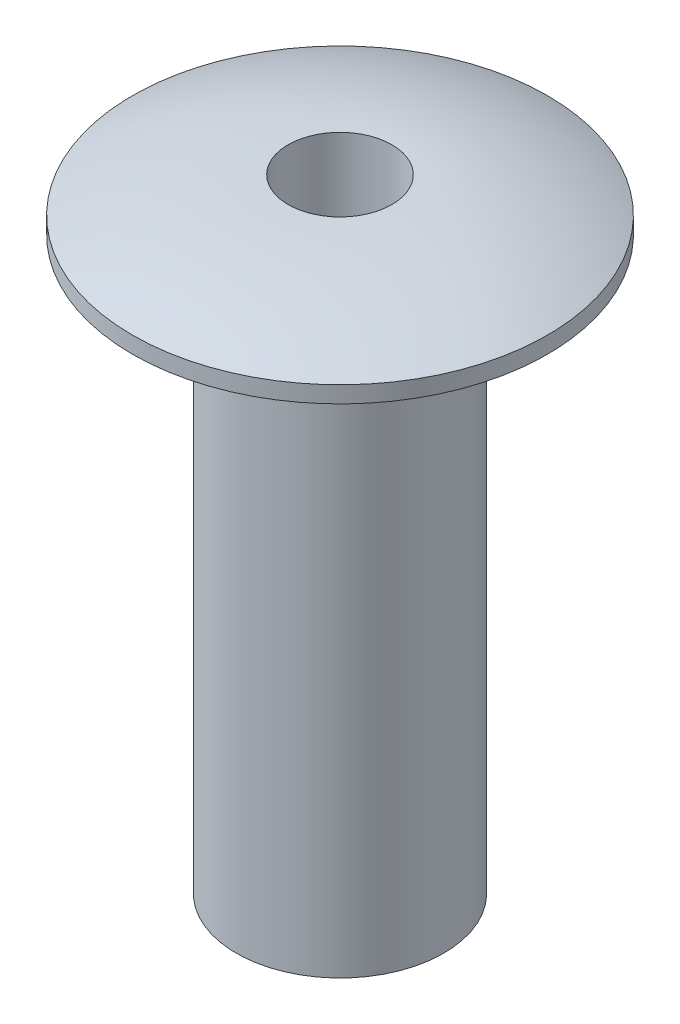
ISO-10303-21;
HEADER;
FILE_DESCRIPTION(('STEP AP214'),'2;1');
FILE_NAME('part.step','',(''),(''),'','','');
FILE_SCHEMA(('AUTOMOTIVE_DESIGN { 1 0 10303 214 1 1 1 1 }'));
ENDSEC;
DATA;
#1=APPLICATION_CONTEXT('core data for automotive mechanical design processes');
#2=APPLICATION_PROTOCOL_DEFINITION('international standard','automotive_design',2000,#1);
#3=PRODUCT_CONTEXT('',#1,'mechanical');
#4=PRODUCT('Part','Part','',(#3));
#5=PRODUCT_RELATED_PRODUCT_CATEGORY('part','',(#4));
#6=PRODUCT_DEFINITION_FORMATION('','',#4);
#7=PRODUCT_DEFINITION_CONTEXT('part definition',#1,'design');
#8=PRODUCT_DEFINITION('design','',#6,#7);
#9=PRODUCT_DEFINITION_SHAPE('','',#8);
#10=(LENGTH_UNIT() NAMED_UNIT(*) SI_UNIT(.MILLI.,.METRE.));
#11=(NAMED_UNIT(*) PLANE_ANGLE_UNIT() SI_UNIT($,.RADIAN.));
#12=(NAMED_UNIT(*) SI_UNIT($,.STERADIAN.) SOLID_ANGLE_UNIT());
#13=UNCERTAINTY_MEASURE_WITH_UNIT(LENGTH_MEASURE(1.E-05),#10,'distance_accuracy_value','');
#14=(GEOMETRIC_REPRESENTATION_CONTEXT(3) GLOBAL_UNCERTAINTY_ASSIGNED_CONTEXT((#13)) GLOBAL_UNIT_ASSIGNED_CONTEXT((#10,
#11,#12)) REPRESENTATION_CONTEXT('',''));
#15=CARTESIAN_POINT('',(0.,0.,0.));
#16=DIRECTION('',(0.,0.,1.));
#17=DIRECTION('',(1.,0.,0.));
#18=AXIS2_PLACEMENT_3D('',#15,#16,#17);
#19=CARTESIAN_POINT('',(0.,4.00236764705881,-0.79375));
#20=DIRECTION('',(1.,0.,0.));
#21=DIRECTION('',(0.,0.,-1.));
#22=AXIS2_PLACEMENT_3D('',#19,#20,#21);
#23=CIRCLE('',#22,5.52263235294119);
#24=TRIMMED_CURVE('',#23,(PARAMETER_VALUE(-1.71502257047458)),
(PARAMETER_VALUE(1.71502257047458)),.T.,.PARAMETER.);
#25=CARTESIAN_POINT('',(0.,4.00236764705881,0.));
#26=DIRECTION('',(0.,-1.,0.));
#27=AXIS1_PLACEMENT('',#25,#26);
#28=SURFACE_OF_REVOLUTION('',#24,#27);
#29=CARTESIAN_POINT('',(0.,9.525,0.));
#30=DIRECTION('',(0.,-1.,0.));
#31=DIRECTION('',(0.,0.,-1.));
#32=AXIS2_PLACEMENT_3D('',#29,#30,#31);
#33=CIRCLE('',#32,0.79375);
#34=CARTESIAN_POINT('',(0.,9.525,-0.79375));
#35=VERTEX_POINT('',#34);
#36=EDGE_CURVE('E36',#35,#35,#33,.T.);
#37=ORIENTED_EDGE('',*,*,#36,.T.);
#38=EDGE_LOOP('',(#37));
#39=FACE_BOUND('',#38,.T.);
#40=CARTESIAN_POINT('',(0.,8.98525,0.));
#41=DIRECTION('',(0.,-1.,0.));
#42=DIRECTION('',(0.,0.,-1.));
#43=AXIS2_PLACEMENT_3D('',#40,#41,#42);
#44=CIRCLE('',#43,3.175);
#45=CARTESIAN_POINT('',(0.,8.98525,-3.175));
#46=VERTEX_POINT('',#45);
#47=EDGE_CURVE('E30',#46,#46,#44,.T.);
#48=ORIENTED_EDGE('',*,*,#47,.F.);
#49=EDGE_LOOP('',(#48));
#50=FACE_BOUND('',#49,.T.);
#51=ADVANCED_FACE('F14',(#39,#50),#28,.F.);
#52=CARTESIAN_POINT('',(0.,0.,0.));
#53=DIRECTION('',(0.,-1.,0.));
#54=DIRECTION('',(0.,0.,-1.));
#55=AXIS2_PLACEMENT_3D('',#52,#53,#54);
#56=CYLINDRICAL_SURFACE('',#55,3.175);
#57=ORIENTED_EDGE('',*,*,#47,.T.);
#58=EDGE_LOOP('',(#57));
#59=FACE_BOUND('',#58,.T.);
#60=CARTESIAN_POINT('',(0.,8.73125,0.));
#61=DIRECTION('',(0.,-1.,0.));
#62=DIRECTION('',(0.,0.,-1.));
#63=AXIS2_PLACEMENT_3D('',#60,#61,#62);
#64=CIRCLE('',#63,3.175);
#65=CARTESIAN_POINT('',(0.,8.73125,-3.175));
#66=VERTEX_POINT('',#65);
#67=EDGE_CURVE('E18',#66,#66,#64,.T.);
#68=ORIENTED_EDGE('',*,*,#67,.F.);
#69=EDGE_LOOP('',(#68));
#70=FACE_BOUND('',#69,.T.);
#71=ADVANCED_FACE('F46',(#59,#70),#56,.T.);
#72=CARTESIAN_POINT('',(0.,0.,0.));
#73=DIRECTION('',(0.,-1.,0.));
#74=DIRECTION('',(0.,0.,-1.));
#75=AXIS2_PLACEMENT_3D('',#72,#73,#74);
#76=CYLINDRICAL_SURFACE('',#75,0.79375);
#77=CARTESIAN_POINT('',(0.,0.,0.));
#78=DIRECTION('',(0.,-1.,0.));
#79=DIRECTION('',(0.,0.,-1.));
#80=AXIS2_PLACEMENT_3D('',#77,#78,#79);
#81=CIRCLE('',#80,0.79375);
#82=CARTESIAN_POINT('',(0.,0.,-0.79375));
#83=VERTEX_POINT('',#82);
#84=EDGE_CURVE('E27',#83,#83,#81,.F.);
#85=ORIENTED_EDGE('',*,*,#84,.F.);
#86=EDGE_LOOP('',(#85));
#87=FACE_BOUND('',#86,.T.);
#88=ORIENTED_EDGE('',*,*,#36,.F.);
#89=EDGE_LOOP('',(#88));
#90=FACE_BOUND('',#89,.T.);
#91=ADVANCED_FACE('F54',(#87,#90),#76,.F.);
#92=CARTESIAN_POINT('',(0.,8.73125,-3.175));
#93=DIRECTION('',(0.,-1.,0.));
#94=DIRECTION('',(0.,0.,-1.));
#95=AXIS2_PLACEMENT_3D('',#92,#93,#94);
#96=PLANE('',#95);
#97=CARTESIAN_POINT('',(0.,8.73125,0.));
#98=DIRECTION('',(0.,-1.,0.));
#99=DIRECTION('',(0.,0.,-1.));
#100=AXIS2_PLACEMENT_3D('',#97,#98,#99);
#101=CIRCLE('',#100,1.5875);
#102=CARTESIAN_POINT('',(0.,8.73125,-1.5875));
#103=VERTEX_POINT('',#102);
#104=EDGE_CURVE('E22',#103,#103,#101,.T.);
#105=ORIENTED_EDGE('',*,*,#104,.F.);
#106=EDGE_LOOP('',(#105));
#107=FACE_BOUND('',#106,.T.);
#108=ORIENTED_EDGE('',*,*,#67,.T.);
#109=EDGE_LOOP('',(#108));
#110=FACE_BOUND('',#109,.T.);
#111=ADVANCED_FACE('F62',(#107,#110),#96,.T.);
#112=CARTESIAN_POINT('',(0.,0.,-1.5875));
#113=DIRECTION('',(0.,-1.,0.));
#114=DIRECTION('',(0.,0.,-1.));
#115=AXIS2_PLACEMENT_3D('',#112,#113,#114);
#116=PLANE('',#115);
#117=ORIENTED_EDGE('',*,*,#84,.T.);
#118=EDGE_LOOP('',(#117));
#119=FACE_BOUND('',#118,.T.);
#120=CARTESIAN_POINT('',(0.,0.,0.));
#121=DIRECTION('',(0.,-1.,0.));
#122=DIRECTION('',(0.,0.,-1.));
#123=AXIS2_PLACEMENT_3D('',#120,#121,#122);
#124=CIRCLE('',#123,1.5875);
#125=CARTESIAN_POINT('',(0.,0.,-1.5875));
#126=VERTEX_POINT('',#125);
#127=EDGE_CURVE('E10',#126,#126,#124,.F.);
#128=ORIENTED_EDGE('',*,*,#127,.F.);
#129=EDGE_LOOP('',(#128));
#130=FACE_BOUND('',#129,.T.);
#131=ADVANCED_FACE('F57',(#119,#130),#116,.T.);
#132=CARTESIAN_POINT('',(0.,0.,0.));
#133=DIRECTION('',(0.,-1.,0.));
#134=DIRECTION('',(0.,0.,-1.));
#135=AXIS2_PLACEMENT_3D('',#132,#133,#134);
#136=CYLINDRICAL_SURFACE('',#135,1.5875);
#137=ORIENTED_EDGE('',*,*,#127,.T.);
#138=EDGE_LOOP('',(#137));
#139=FACE_BOUND('',#138,.T.);
#140=ORIENTED_EDGE('',*,*,#104,.T.);
#141=EDGE_LOOP('',(#140));
#142=FACE_BOUND('',#141,.T.);
#143=ADVANCED_FACE('F55',(#139,#142),#136,.T.);
#144=CLOSED_SHELL('',(#51,#71,#91,#111,#131,#143));
#145=MANIFOLD_SOLID_BREP('B1',#144);
#146=ADVANCED_BREP_SHAPE_REPRESENTATION('',(#18,#145),#14);
#147=SHAPE_DEFINITION_REPRESENTATION(#9,#146);
ENDSEC;
END-ISO-10303-21;
